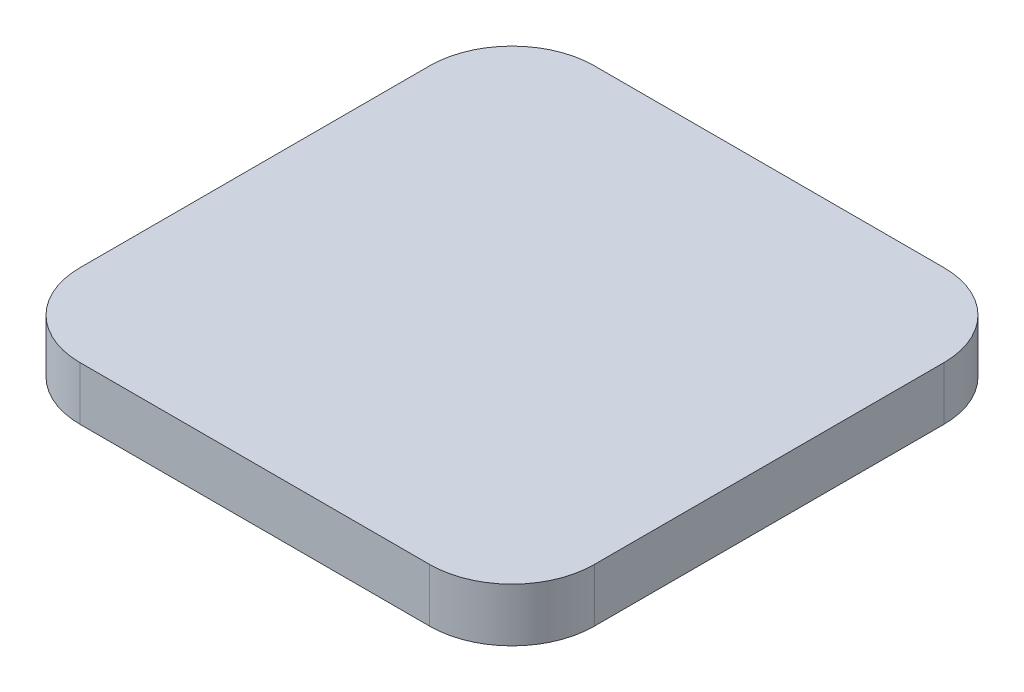
ISO-10303-21;
HEADER;
FILE_DESCRIPTION(('STEP AP214'),'2;1');
FILE_NAME('part.step','',(''),(''),'','','');
FILE_SCHEMA(('AUTOMOTIVE_DESIGN { 1 0 10303 214 1 1 1 1 }'));
ENDSEC;
DATA;
#1=APPLICATION_CONTEXT('core data for automotive mechanical design processes');
#2=APPLICATION_PROTOCOL_DEFINITION('international standard','automotive_design',2000,#1);
#3=PRODUCT_CONTEXT('',#1,'mechanical');
#4=PRODUCT('Part','Part','',(#3));
#5=PRODUCT_RELATED_PRODUCT_CATEGORY('part','',(#4));
#6=PRODUCT_DEFINITION_FORMATION('','',#4);
#7=PRODUCT_DEFINITION_CONTEXT('part definition',#1,'design');
#8=PRODUCT_DEFINITION('design','',#6,#7);
#9=PRODUCT_DEFINITION_SHAPE('','',#8);
#10=(LENGTH_UNIT() NAMED_UNIT(*) SI_UNIT(.MILLI.,.METRE.));
#11=(NAMED_UNIT(*) PLANE_ANGLE_UNIT() SI_UNIT($,.RADIAN.));
#12=(NAMED_UNIT(*) SI_UNIT($,.STERADIAN.) SOLID_ANGLE_UNIT());
#13=UNCERTAINTY_MEASURE_WITH_UNIT(LENGTH_MEASURE(1.E-05),#10,'distance_accuracy_value','');
#14=(GEOMETRIC_REPRESENTATION_CONTEXT(3) GLOBAL_UNCERTAINTY_ASSIGNED_CONTEXT((#13)) GLOBAL_UNIT_ASSIGNED_CONTEXT((#10,
#11,#12)) REPRESENTATION_CONTEXT('',''));
#15=CARTESIAN_POINT('',(0.,0.,0.));
#16=DIRECTION('',(0.,0.,1.));
#17=DIRECTION('',(1.,0.,0.));
#18=AXIS2_PLACEMENT_3D('',#15,#16,#17);
#19=CARTESIAN_POINT('',(0.,0.,0.));
#20=DIRECTION('',(0.,-1.,0.));
#21=DIRECTION('',(0.,0.,-1.));
#22=AXIS2_PLACEMENT_3D('',#19,#20,#21);
#23=PLANE('',#22);
#24=DIRECTION('',(-1.,0.,0.));
#25=VECTOR('',#24,1.);
#26=CARTESIAN_POINT('',(-12.5,0.,-12.5));
#27=LINE('',#26,#25);
#28=CARTESIAN_POINT('',(8.49999999999999,0.,-12.5));
#29=VERTEX_POINT('',#28);
#30=CARTESIAN_POINT('',(-8.50000000000001,0.,-12.5));
#31=VERTEX_POINT('',#30);
#32=EDGE_CURVE('E116',#29,#31,#27,.T.);
#33=ORIENTED_EDGE('',*,*,#32,.F.);
#34=CARTESIAN_POINT('',(8.49999999999999,0.,-8.50000000000001));
#35=DIRECTION('',(0.,-1.,0.));
#36=DIRECTION('',(0.,0.,-1.));
#37=AXIS2_PLACEMENT_3D('',#34,#35,#36);
#38=CIRCLE('',#37,4.);
#39=CARTESIAN_POINT('',(12.5,0.,-8.50000000000001));
#40=VERTEX_POINT('',#39);
#41=EDGE_CURVE('E99',#29,#40,#38,.T.);
#42=ORIENTED_EDGE('',*,*,#41,.T.);
#43=DIRECTION('',(0.,0.,-1.));
#44=VECTOR('',#43,1.);
#45=CARTESIAN_POINT('',(12.5,0.,12.5));
#46=LINE('',#45,#44);
#47=CARTESIAN_POINT('',(12.5,0.,8.49999999999999));
#48=VERTEX_POINT('',#47);
#49=EDGE_CURVE('E127',#48,#40,#46,.T.);
#50=ORIENTED_EDGE('',*,*,#49,.F.);
#51=CARTESIAN_POINT('',(8.49999999999999,0.,8.49999999999999));
#52=DIRECTION('',(0.,-1.,0.));
#53=DIRECTION('',(0.,0.,-1.));
#54=AXIS2_PLACEMENT_3D('',#51,#52,#53);
#55=CIRCLE('',#54,4.);
#56=CARTESIAN_POINT('',(8.49999999999999,0.,12.5));
#57=VERTEX_POINT('',#56);
#58=EDGE_CURVE('E110',#48,#57,#55,.T.);
#59=ORIENTED_EDGE('',*,*,#58,.T.);
#60=DIRECTION('',(1.,0.,0.));
#61=VECTOR('',#60,1.);
#62=CARTESIAN_POINT('',(-12.5,0.,12.5));
#63=LINE('',#62,#61);
#64=CARTESIAN_POINT('',(-8.50000000000001,0.,12.5));
#65=VERTEX_POINT('',#64);
#66=EDGE_CURVE('E130',#65,#57,#63,.T.);
#67=ORIENTED_EDGE('',*,*,#66,.F.);
#68=CARTESIAN_POINT('',(-8.50000000000001,0.,8.49999999999999));
#69=DIRECTION('',(0.,-1.,0.));
#70=DIRECTION('',(0.,0.,-1.));
#71=AXIS2_PLACEMENT_3D('',#68,#69,#70);
#72=CIRCLE('',#71,4.);
#73=CARTESIAN_POINT('',(-12.5,0.,8.49999999999999));
#74=VERTEX_POINT('',#73);
#75=EDGE_CURVE('E120',#65,#74,#72,.T.);
#76=ORIENTED_EDGE('',*,*,#75,.T.);
#77=DIRECTION('',(0.,0.,1.));
#78=VECTOR('',#77,1.);
#79=CARTESIAN_POINT('',(-12.5,0.,12.5));
#80=LINE('',#79,#78);
#81=CARTESIAN_POINT('',(-12.5,0.,-8.50000000000001));
#82=VERTEX_POINT('',#81);
#83=EDGE_CURVE('E126',#82,#74,#80,.T.);
#84=ORIENTED_EDGE('',*,*,#83,.F.);
#85=CARTESIAN_POINT('',(-8.50000000000001,0.,-8.50000000000001));
#86=DIRECTION('',(0.,-1.,0.));
#87=DIRECTION('',(0.,0.,-1.));
#88=AXIS2_PLACEMENT_3D('',#85,#86,#87);
#89=CIRCLE('',#88,4.);
#90=EDGE_CURVE('E125',#82,#31,#89,.T.);
#91=ORIENTED_EDGE('',*,*,#90,.T.);
#92=EDGE_LOOP('',(#33,#42,#50,#59,#67,#76,#84,#91));
#93=FACE_BOUND('',#92,.T.);
#94=CARTESIAN_POINT('',(0.,0.,-2.5));
#95=DIRECTION('',(0.,-1.,0.));
#96=DIRECTION('',(0.,0.,-1.));
#97=AXIS2_PLACEMENT_3D('',#94,#95,#96);
#98=CIRCLE('',#97,0.4);
#99=CARTESIAN_POINT('',(0.,0.,-2.9));
#100=VERTEX_POINT('',#99);
#101=EDGE_CURVE('E180',#100,#100,#98,.T.);
#102=ORIENTED_EDGE('',*,*,#101,.F.);
#103=EDGE_LOOP('',(#102));
#104=FACE_BOUND('',#103,.T.);
#105=ADVANCED_FACE('F32',(#93,#104),#23,.T.);
#106=CARTESIAN_POINT('',(12.5,2.6,12.5));
#107=DIRECTION('',(-1.,0.,0.));
#108=DIRECTION('',(0.,0.,1.));
#109=AXIS2_PLACEMENT_3D('',#106,#107,#108);
#110=PLANE('',#109);
#111=ORIENTED_EDGE('',*,*,#49,.T.);
#112=DIRECTION('',(0.,-1.,0.));
#113=VECTOR('',#112,1.);
#114=CARTESIAN_POINT('',(12.5,2.6,-8.50000000000001));
#115=LINE('',#114,#113);
#116=CARTESIAN_POINT('',(12.5,2.6,-8.50000000000001));
#117=VERTEX_POINT('',#116);
#118=EDGE_CURVE('E104',#40,#117,#115,.F.);
#119=ORIENTED_EDGE('',*,*,#118,.T.);
#120=DIRECTION('',(0.,0.,-1.));
#121=VECTOR('',#120,1.);
#122=CARTESIAN_POINT('',(12.5,2.6,12.5));
#123=LINE('',#122,#121);
#124=CARTESIAN_POINT('',(12.5,2.6,8.49999999999999));
#125=VERTEX_POINT('',#124);
#126=EDGE_CURVE('E137',#125,#117,#123,.T.);
#127=ORIENTED_EDGE('',*,*,#126,.F.);
#128=DIRECTION('',(0.,-1.,0.));
#129=VECTOR('',#128,1.);
#130=CARTESIAN_POINT('',(12.5,2.6,8.49999999999999));
#131=LINE('',#130,#129);
#132=EDGE_CURVE('E109',#125,#48,#131,.T.);
#133=ORIENTED_EDGE('',*,*,#132,.T.);
#134=EDGE_LOOP('',(#111,#119,#127,#133));
#135=FACE_BOUND('',#134,.T.);
#136=ADVANCED_FACE('F176',(#135),#110,.F.);
#137=CARTESIAN_POINT('',(-12.5,2.6,-12.5));
#138=DIRECTION('',(0.,0.,1.));
#139=DIRECTION('',(1.,0.,0.));
#140=AXIS2_PLACEMENT_3D('',#137,#138,#139);
#141=PLANE('',#140);
#142=DIRECTION('',(-1.,0.,0.));
#143=VECTOR('',#142,1.);
#144=CARTESIAN_POINT('',(-12.5,2.6,-12.5));
#145=LINE('',#144,#143);
#146=CARTESIAN_POINT('',(8.49999999999999,2.6,-12.5));
#147=VERTEX_POINT('',#146);
#148=CARTESIAN_POINT('',(-8.50000000000001,2.6,-12.5));
#149=VERTEX_POINT('',#148);
#150=EDGE_CURVE('E119',#147,#149,#145,.T.);
#151=ORIENTED_EDGE('',*,*,#150,.F.);
#152=DIRECTION('',(0.,-1.,0.));
#153=VECTOR('',#152,1.);
#154=CARTESIAN_POINT('',(8.49999999999999,2.6,-12.5));
#155=LINE('',#154,#153);
#156=EDGE_CURVE('E103',#147,#29,#155,.T.);
#157=ORIENTED_EDGE('',*,*,#156,.T.);
#158=ORIENTED_EDGE('',*,*,#32,.T.);
#159=DIRECTION('',(0.,-1.,0.));
#160=VECTOR('',#159,1.);
#161=CARTESIAN_POINT('',(-8.50000000000001,2.6,-12.5));
#162=LINE('',#161,#160);
#163=EDGE_CURVE('E121',#31,#149,#162,.F.);
#164=ORIENTED_EDGE('',*,*,#163,.T.);
#165=EDGE_LOOP('',(#151,#157,#158,#164));
#166=FACE_BOUND('',#165,.T.);
#167=ADVANCED_FACE('F115',(#166),#141,.F.);
#168=CARTESIAN_POINT('',(-12.5,2.6,12.5));
#169=DIRECTION('',(1.,0.,0.));
#170=DIRECTION('',(0.,0.,-1.));
#171=AXIS2_PLACEMENT_3D('',#168,#169,#170);
#172=PLANE('',#171);
#173=DIRECTION('',(0.,0.,1.));
#174=VECTOR('',#173,1.);
#175=CARTESIAN_POINT('',(-12.5,2.6,12.5));
#176=LINE('',#175,#174);
#177=CARTESIAN_POINT('',(-12.5,2.6,-8.50000000000001));
#178=VERTEX_POINT('',#177);
#179=CARTESIAN_POINT('',(-12.5,2.6,8.49999999999999));
#180=VERTEX_POINT('',#179);
#181=EDGE_CURVE('E160',#178,#180,#176,.T.);
#182=ORIENTED_EDGE('',*,*,#181,.F.);
#183=DIRECTION('',(0.,-1.,0.));
#184=VECTOR('',#183,1.);
#185=CARTESIAN_POINT('',(-12.5,2.6,-8.50000000000001));
#186=LINE('',#185,#184);
#187=EDGE_CURVE('E11',#178,#82,#186,.T.);
#188=ORIENTED_EDGE('',*,*,#187,.T.);
#189=ORIENTED_EDGE('',*,*,#83,.T.);
#190=DIRECTION('',(0.,-1.,0.));
#191=VECTOR('',#190,1.);
#192=CARTESIAN_POINT('',(-12.5,2.6,8.49999999999999));
#193=LINE('',#192,#191);
#194=EDGE_CURVE('E40',#74,#180,#193,.F.);
#195=ORIENTED_EDGE('',*,*,#194,.T.);
#196=EDGE_LOOP('',(#182,#188,#189,#195));
#197=FACE_BOUND('',#196,.T.);
#198=ADVANCED_FACE('F159',(#197),#172,.F.);
#199=CARTESIAN_POINT('',(-12.5,2.6,12.5));
#200=DIRECTION('',(0.,0.,-1.));
#201=DIRECTION('',(-1.,0.,0.));
#202=AXIS2_PLACEMENT_3D('',#199,#200,#201);
#203=PLANE('',#202);
#204=ORIENTED_EDGE('',*,*,#66,.T.);
#205=DIRECTION('',(0.,-1.,0.));
#206=VECTOR('',#205,1.);
#207=CARTESIAN_POINT('',(8.49999999999999,2.6,12.5));
#208=LINE('',#207,#206);
#209=CARTESIAN_POINT('',(8.49999999999999,2.6,12.5));
#210=VERTEX_POINT('',#209);
#211=EDGE_CURVE('E47',#57,#210,#208,.F.);
#212=ORIENTED_EDGE('',*,*,#211,.T.);
#213=DIRECTION('',(1.,0.,0.));
#214=VECTOR('',#213,1.);
#215=CARTESIAN_POINT('',(-12.5,2.6,12.5));
#216=LINE('',#215,#214);
#217=CARTESIAN_POINT('',(-8.50000000000001,2.6,12.5));
#218=VERTEX_POINT('',#217);
#219=EDGE_CURVE('E138',#218,#210,#216,.T.);
#220=ORIENTED_EDGE('',*,*,#219,.F.);
#221=DIRECTION('',(0.,-1.,0.));
#222=VECTOR('',#221,1.);
#223=CARTESIAN_POINT('',(-8.50000000000001,2.6,12.5));
#224=LINE('',#223,#222);
#225=EDGE_CURVE('E153',#218,#65,#224,.T.);
#226=ORIENTED_EDGE('',*,*,#225,.T.);
#227=EDGE_LOOP('',(#204,#212,#220,#226));
#228=FACE_BOUND('',#227,.T.);
#229=ADVANCED_FACE('F169',(#228),#203,.F.);
#230=CARTESIAN_POINT('',(0.,2.6,0.));
#231=DIRECTION('',(0.,-1.,0.));
#232=DIRECTION('',(0.,0.,-1.));
#233=AXIS2_PLACEMENT_3D('',#230,#231,#232);
#234=PLANE('',#233);
#235=ORIENTED_EDGE('',*,*,#126,.T.);
#236=CARTESIAN_POINT('',(8.49999999999999,2.6,-8.50000000000001));
#237=DIRECTION('',(0.,-1.,0.));
#238=DIRECTION('',(0.,0.,-1.));
#239=AXIS2_PLACEMENT_3D('',#236,#237,#238);
#240=CIRCLE('',#239,4.);
#241=EDGE_CURVE('E151',#117,#147,#240,.F.);
#242=ORIENTED_EDGE('',*,*,#241,.T.);
#243=ORIENTED_EDGE('',*,*,#150,.T.);
#244=CARTESIAN_POINT('',(-8.50000000000001,2.6,-8.50000000000001));
#245=DIRECTION('',(0.,-1.,0.));
#246=DIRECTION('',(0.,0.,-1.));
#247=AXIS2_PLACEMENT_3D('',#244,#245,#246);
#248=CIRCLE('',#247,4.);
#249=EDGE_CURVE('E147',#149,#178,#248,.F.);
#250=ORIENTED_EDGE('',*,*,#249,.T.);
#251=ORIENTED_EDGE('',*,*,#181,.T.);
#252=CARTESIAN_POINT('',(-8.50000000000001,2.6,8.49999999999999));
#253=DIRECTION('',(0.,-1.,0.));
#254=DIRECTION('',(0.,0.,-1.));
#255=AXIS2_PLACEMENT_3D('',#252,#253,#254);
#256=CIRCLE('',#255,4.);
#257=EDGE_CURVE('E54',#180,#218,#256,.F.);
#258=ORIENTED_EDGE('',*,*,#257,.T.);
#259=ORIENTED_EDGE('',*,*,#219,.T.);
#260=CARTESIAN_POINT('',(8.49999999999999,2.6,8.49999999999999));
#261=DIRECTION('',(0.,-1.,0.));
#262=DIRECTION('',(0.,0.,-1.));
#263=AXIS2_PLACEMENT_3D('',#260,#261,#262);
#264=CIRCLE('',#263,4.);
#265=EDGE_CURVE('E149',#210,#125,#264,.F.);
#266=ORIENTED_EDGE('',*,*,#265,.T.);
#267=EDGE_LOOP('',(#235,#242,#243,#250,#251,#258,#259,#266));
#268=FACE_BOUND('',#267,.T.);
#269=ADVANCED_FACE('F164',(#268),#234,.F.);
#270=CARTESIAN_POINT('',(8.49999999999999,2.6,-8.50000000000001));
#271=DIRECTION('',(0.,-1.,0.));
#272=DIRECTION('',(0.,0.,-1.));
#273=AXIS2_PLACEMENT_3D('',#270,#271,#272);
#274=CYLINDRICAL_SURFACE('',#273,4.);
#275=ORIENTED_EDGE('',*,*,#241,.F.);
#276=ORIENTED_EDGE('',*,*,#118,.F.);
#277=ORIENTED_EDGE('',*,*,#41,.F.);
#278=ORIENTED_EDGE('',*,*,#156,.F.);
#279=EDGE_LOOP('',(#275,#276,#277,#278));
#280=FACE_BOUND('',#279,.T.);
#281=ADVANCED_FACE('F102',(#280),#274,.T.);
#282=CARTESIAN_POINT('',(8.49999999999999,2.6,8.49999999999999));
#283=DIRECTION('',(0.,-1.,0.));
#284=DIRECTION('',(0.,0.,-1.));
#285=AXIS2_PLACEMENT_3D('',#282,#283,#284);
#286=CYLINDRICAL_SURFACE('',#285,4.);
#287=ORIENTED_EDGE('',*,*,#265,.F.);
#288=ORIENTED_EDGE('',*,*,#211,.F.);
#289=ORIENTED_EDGE('',*,*,#58,.F.);
#290=ORIENTED_EDGE('',*,*,#132,.F.);
#291=EDGE_LOOP('',(#287,#288,#289,#290));
#292=FACE_BOUND('',#291,.T.);
#293=ADVANCED_FACE('F173',(#292),#286,.T.);
#294=CARTESIAN_POINT('',(-8.50000000000001,2.6,-8.50000000000001));
#295=DIRECTION('',(0.,-1.,0.));
#296=DIRECTION('',(0.,0.,-1.));
#297=AXIS2_PLACEMENT_3D('',#294,#295,#296);
#298=CYLINDRICAL_SURFACE('',#297,4.);
#299=ORIENTED_EDGE('',*,*,#249,.F.);
#300=ORIENTED_EDGE('',*,*,#163,.F.);
#301=ORIENTED_EDGE('',*,*,#90,.F.);
#302=ORIENTED_EDGE('',*,*,#187,.F.);
#303=EDGE_LOOP('',(#299,#300,#301,#302));
#304=FACE_BOUND('',#303,.T.);
#305=ADVANCED_FACE('F210',(#304),#298,.T.);
#306=CARTESIAN_POINT('',(-8.50000000000001,2.6,8.49999999999999));
#307=DIRECTION('',(0.,-1.,0.));
#308=DIRECTION('',(0.,0.,-1.));
#309=AXIS2_PLACEMENT_3D('',#306,#307,#308);
#310=CYLINDRICAL_SURFACE('',#309,4.);
#311=ORIENTED_EDGE('',*,*,#257,.F.);
#312=ORIENTED_EDGE('',*,*,#194,.F.);
#313=ORIENTED_EDGE('',*,*,#75,.F.);
#314=ORIENTED_EDGE('',*,*,#225,.F.);
#315=EDGE_LOOP('',(#311,#312,#313,#314));
#316=FACE_BOUND('',#315,.T.);
#317=ADVANCED_FACE('F34',(#316),#310,.T.);
#318=CARTESIAN_POINT('',(0.,-1.9,-2.5));
#319=DIRECTION('',(0.,1.,0.));
#320=DIRECTION('',(0.,0.,1.));
#321=AXIS2_PLACEMENT_3D('',#318,#319,#320);
#322=CYLINDRICAL_SURFACE('',#321,0.4);
#323=CARTESIAN_POINT('',(0.,-1.9,-2.5));
#324=DIRECTION('',(0.,-1.,0.));
#325=DIRECTION('',(0.,0.,-1.));
#326=AXIS2_PLACEMENT_3D('',#323,#324,#325);
#327=CIRCLE('',#326,0.4);
#328=CARTESIAN_POINT('',(0.,-1.9,-2.9));
#329=VERTEX_POINT('',#328);
#330=EDGE_CURVE('E132',#329,#329,#327,.T.);
#331=ORIENTED_EDGE('',*,*,#330,.F.);
#332=EDGE_LOOP('',(#331));
#333=FACE_BOUND('',#332,.T.);
#334=ORIENTED_EDGE('',*,*,#101,.T.);
#335=EDGE_LOOP('',(#334));
#336=FACE_BOUND('',#335,.T.);
#337=ADVANCED_FACE('F188',(#333,#336),#322,.T.);
#338=CARTESIAN_POINT('',(0.,-1.9,-2.5));
#339=DIRECTION('',(0.,-1.,0.));
#340=DIRECTION('',(0.,0.,-1.));
#341=AXIS2_PLACEMENT_3D('',#338,#339,#340);
#342=PLANE('',#341);
#343=ORIENTED_EDGE('',*,*,#330,.T.);
#344=EDGE_LOOP('',(#343));
#345=FACE_BOUND('',#344,.T.);
#346=ADVANCED_FACE('F186',(#345),#342,.T.);
#347=CLOSED_SHELL('',(#105,#136,#167,#198,#229,#269,#281,#293,#305,#317,#337,#346));
#348=MANIFOLD_SOLID_BREP('B2',#347);
#349=ADVANCED_BREP_SHAPE_REPRESENTATION('',(#18,#348),#14);
#350=SHAPE_DEFINITION_REPRESENTATION(#9,#349);
ENDSEC;
END-ISO-10303-21;
